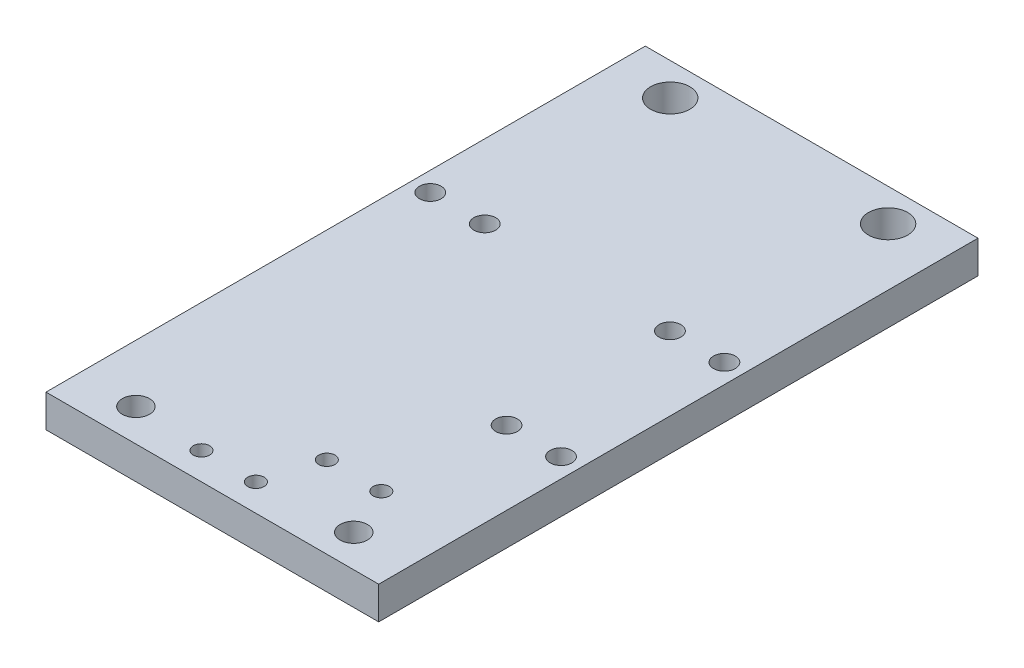
ISO-10303-21;
HEADER;
FILE_DESCRIPTION(('STEP AP214'),'2;1');
FILE_NAME('part.step','',(''),(''),'','','');
FILE_SCHEMA(('AUTOMOTIVE_DESIGN { 1 0 10303 214 1 1 1 1 }'));
ENDSEC;
DATA;
#1=APPLICATION_CONTEXT('core data for automotive mechanical design processes');
#2=APPLICATION_PROTOCOL_DEFINITION('international standard','automotive_design',2000,#1);
#3=PRODUCT_CONTEXT('',#1,'mechanical');
#4=PRODUCT('Part','Part','',(#3));
#5=PRODUCT_RELATED_PRODUCT_CATEGORY('part','',(#4));
#6=PRODUCT_DEFINITION_FORMATION('','',#4);
#7=PRODUCT_DEFINITION_CONTEXT('part definition',#1,'design');
#8=PRODUCT_DEFINITION('design','',#6,#7);
#9=PRODUCT_DEFINITION_SHAPE('','',#8);
#10=(LENGTH_UNIT() NAMED_UNIT(*) SI_UNIT(.MILLI.,.METRE.));
#11=(NAMED_UNIT(*) PLANE_ANGLE_UNIT() SI_UNIT($,.RADIAN.));
#12=(NAMED_UNIT(*) SI_UNIT($,.STERADIAN.) SOLID_ANGLE_UNIT());
#13=UNCERTAINTY_MEASURE_WITH_UNIT(LENGTH_MEASURE(1.E-05),#10,'distance_accuracy_value','');
#14=(GEOMETRIC_REPRESENTATION_CONTEXT(3) GLOBAL_UNCERTAINTY_ASSIGNED_CONTEXT((#13)) GLOBAL_UNIT_ASSIGNED_CONTEXT((#10,
#11,#12)) REPRESENTATION_CONTEXT('',''));
#15=CARTESIAN_POINT('',(0.,0.,0.));
#16=DIRECTION('',(0.,0.,1.));
#17=DIRECTION('',(1.,0.,0.));
#18=AXIS2_PLACEMENT_3D('',#15,#16,#17);
#19=CARTESIAN_POINT('',(-30.5417607223479,6.,55.0161812297735));
#20=DIRECTION('',(0.,0.,-1.));
#21=DIRECTION('',(-1.,0.,0.));
#22=AXIS2_PLACEMENT_3D('',#19,#20,#21);
#23=PLANE('',#22);
#24=DIRECTION('',(1.,0.,0.));
#25=VECTOR('',#24,1.);
#26=CARTESIAN_POINT('',(-30.5417607223479,0.,55.0161812297735));
#27=LINE('',#26,#25);
#28=CARTESIAN_POINT('',(-30.5417607223479,0.,55.0161812297735));
#29=VERTEX_POINT('',#28);
#30=CARTESIAN_POINT('',(30.5417607223479,0.,55.0161812297735));
#31=VERTEX_POINT('',#30);
#32=EDGE_CURVE('E96',#29,#31,#27,.T.);
#33=ORIENTED_EDGE('',*,*,#32,.T.);
#34=DIRECTION('',(0.,-1.,0.));
#35=VECTOR('',#34,1.);
#36=CARTESIAN_POINT('',(30.5417607223479,6.,55.0161812297735));
#37=LINE('',#36,#35);
#38=CARTESIAN_POINT('',(30.5417607223479,6.,55.0161812297735));
#39=VERTEX_POINT('',#38);
#40=EDGE_CURVE('E11',#39,#31,#37,.T.);
#41=ORIENTED_EDGE('',*,*,#40,.F.);
#42=DIRECTION('',(1.,0.,0.));
#43=VECTOR('',#42,1.);
#44=CARTESIAN_POINT('',(-30.5417607223479,6.,55.0161812297735));
#45=LINE('',#44,#43);
#46=CARTESIAN_POINT('',(-30.5417607223479,6.,55.0161812297735));
#47=VERTEX_POINT('',#46);
#48=EDGE_CURVE('E81',#47,#39,#45,.T.);
#49=ORIENTED_EDGE('',*,*,#48,.F.);
#50=DIRECTION('',(0.,-1.,0.));
#51=VECTOR('',#50,1.);
#52=CARTESIAN_POINT('',(-30.5417607223479,6.,55.0161812297735));
#53=LINE('',#52,#51);
#54=EDGE_CURVE('E92',#47,#29,#53,.T.);
#55=ORIENTED_EDGE('',*,*,#54,.T.);
#56=EDGE_LOOP('',(#33,#41,#49,#55));
#57=FACE_BOUND('',#56,.T.);
#58=ADVANCED_FACE('F32',(#57),#23,.F.);
#59=CARTESIAN_POINT('',(30.5417607223479,6.,55.0161812297735));
#60=DIRECTION('',(-1.,0.,0.));
#61=DIRECTION('',(0.,0.,1.));
#62=AXIS2_PLACEMENT_3D('',#59,#60,#61);
#63=PLANE('',#62);
#64=DIRECTION('',(0.,0.,-1.));
#65=VECTOR('',#64,1.);
#66=CARTESIAN_POINT('',(30.5417607223479,0.,55.0161812297735));
#67=LINE('',#66,#65);
#68=CARTESIAN_POINT('',(30.5417607223479,0.,-55.0161812297734));
#69=VERTEX_POINT('',#68);
#70=EDGE_CURVE('E86',#31,#69,#67,.T.);
#71=ORIENTED_EDGE('',*,*,#70,.T.);
#72=DIRECTION('',(0.,-1.,0.));
#73=VECTOR('',#72,1.);
#74=CARTESIAN_POINT('',(30.5417607223479,6.,-55.0161812297734));
#75=LINE('',#74,#73);
#76=CARTESIAN_POINT('',(30.5417607223479,6.,-55.0161812297734));
#77=VERTEX_POINT('',#76);
#78=EDGE_CURVE('E40',#77,#69,#75,.T.);
#79=ORIENTED_EDGE('',*,*,#78,.F.);
#80=DIRECTION('',(0.,0.,-1.));
#81=VECTOR('',#80,1.);
#82=CARTESIAN_POINT('',(30.5417607223479,6.,55.0161812297735));
#83=LINE('',#82,#81);
#84=EDGE_CURVE('E75',#39,#77,#83,.T.);
#85=ORIENTED_EDGE('',*,*,#84,.F.);
#86=ORIENTED_EDGE('',*,*,#40,.T.);
#87=EDGE_LOOP('',(#71,#79,#85,#86));
#88=FACE_BOUND('',#87,.T.);
#89=ADVANCED_FACE('F85',(#88),#63,.F.);
#90=CARTESIAN_POINT('',(30.5417607223479,6.,-55.0161812297734));
#91=DIRECTION('',(0.,0.,1.));
#92=DIRECTION('',(1.,0.,0.));
#93=AXIS2_PLACEMENT_3D('',#90,#91,#92);
#94=PLANE('',#93);
#95=DIRECTION('',(-1.,0.,0.));
#96=VECTOR('',#95,1.);
#97=CARTESIAN_POINT('',(30.5417607223479,0.,-55.0161812297734));
#98=LINE('',#97,#96);
#99=CARTESIAN_POINT('',(-30.5417607223479,0.,-55.0161812297734));
#100=VERTEX_POINT('',#99);
#101=EDGE_CURVE('E101',#69,#100,#98,.T.);
#102=ORIENTED_EDGE('',*,*,#101,.T.);
#103=DIRECTION('',(0.,-1.,0.));
#104=VECTOR('',#103,1.);
#105=CARTESIAN_POINT('',(-30.5417607223479,6.,-55.0161812297734));
#106=LINE('',#105,#104);
#107=CARTESIAN_POINT('',(-30.5417607223479,6.,-55.0161812297734));
#108=VERTEX_POINT('',#107);
#109=EDGE_CURVE('E89',#108,#100,#106,.T.);
#110=ORIENTED_EDGE('',*,*,#109,.F.);
#111=DIRECTION('',(-1.,0.,0.));
#112=VECTOR('',#111,1.);
#113=CARTESIAN_POINT('',(30.5417607223479,6.,-55.0161812297734));
#114=LINE('',#113,#112);
#115=EDGE_CURVE('E78',#77,#108,#114,.T.);
#116=ORIENTED_EDGE('',*,*,#115,.F.);
#117=ORIENTED_EDGE('',*,*,#78,.T.);
#118=EDGE_LOOP('',(#102,#110,#116,#117));
#119=FACE_BOUND('',#118,.T.);
#120=ADVANCED_FACE('F90',(#119),#94,.F.);
#121=CARTESIAN_POINT('',(-30.5417607223479,6.,-29.2));
#122=DIRECTION('',(1.,0.,0.));
#123=DIRECTION('',(0.,0.,-1.));
#124=AXIS2_PLACEMENT_3D('',#121,#122,#123);
#125=PLANE('',#124);
#126=DIRECTION('',(0.,0.,1.));
#127=VECTOR('',#126,1.);
#128=CARTESIAN_POINT('',(-30.5417607223479,0.,-29.2));
#129=LINE('',#128,#127);
#130=EDGE_CURVE('E65',#100,#29,#129,.T.);
#131=ORIENTED_EDGE('',*,*,#130,.T.);
#132=ORIENTED_EDGE('',*,*,#54,.F.);
#133=DIRECTION('',(0.,0.,-1.));
#134=VECTOR('',#133,1.);
#135=CARTESIAN_POINT('',(-30.5417607223479,6.,-29.2));
#136=LINE('',#135,#134);
#137=EDGE_CURVE('E48',#47,#108,#136,.T.);
#138=ORIENTED_EDGE('',*,*,#137,.T.);
#139=ORIENTED_EDGE('',*,*,#109,.T.);
#140=EDGE_LOOP('',(#131,#132,#138,#139));
#141=FACE_BOUND('',#140,.T.);
#142=ADVANCED_FACE('F105',(#141),#125,.F.);
#143=CARTESIAN_POINT('',(0.,6.,0.));
#144=DIRECTION('',(0.,1.,0.));
#145=DIRECTION('',(0.,0.,1.));
#146=AXIS2_PLACEMENT_3D('',#143,#144,#145);
#147=PLANE('',#146);
#148=CARTESIAN_POINT('',(16.,6.,40.));
#149=DIRECTION('',(0.,1.,0.));
#150=DIRECTION('',(0.,0.,1.));
#151=AXIS2_PLACEMENT_3D('',#148,#149,#150);
#152=CIRCLE('',#151,1.5);
#153=CARTESIAN_POINT('',(16.,6.,41.5));
#154=VERTEX_POINT('',#153);
#155=EDGE_CURVE('E187',#154,#154,#152,.T.);
#156=ORIENTED_EDGE('',*,*,#155,.F.);
#157=EDGE_LOOP('',(#156));
#158=FACE_BOUND('',#157,.T.);
#159=CARTESIAN_POINT('',(6.,6.,40.));
#160=DIRECTION('',(0.,1.,0.));
#161=DIRECTION('',(0.,0.,1.));
#162=AXIS2_PLACEMENT_3D('',#159,#160,#161);
#163=CIRCLE('',#162,1.5);
#164=CARTESIAN_POINT('',(6.,6.,41.5));
#165=VERTEX_POINT('',#164);
#166=EDGE_CURVE('E181',#165,#165,#163,.T.);
#167=ORIENTED_EDGE('',*,*,#166,.F.);
#168=EDGE_LOOP('',(#167));
#169=FACE_BOUND('',#168,.T.);
#170=CARTESIAN_POINT('',(-17.,6.,-12.));
#171=DIRECTION('',(0.,1.,0.));
#172=DIRECTION('',(0.,0.,1.));
#173=AXIS2_PLACEMENT_3D('',#170,#171,#172);
#174=CIRCLE('',#173,2.);
#175=CARTESIAN_POINT('',(-17.,6.,-10.));
#176=VERTEX_POINT('',#175);
#177=EDGE_CURVE('E175',#176,#176,#174,.T.);
#178=ORIENTED_EDGE('',*,*,#177,.F.);
#179=EDGE_LOOP('',(#178));
#180=FACE_BOUND('',#179,.T.);
#181=CARTESIAN_POINT('',(-27.,6.,-12.));
#182=DIRECTION('',(0.,1.,0.));
#183=DIRECTION('',(0.,0.,1.));
#184=AXIS2_PLACEMENT_3D('',#181,#182,#183);
#185=CIRCLE('',#184,2.);
#186=CARTESIAN_POINT('',(-27.,6.,-10.));
#187=VERTEX_POINT('',#186);
#188=EDGE_CURVE('E169',#187,#187,#185,.T.);
#189=ORIENTED_EDGE('',*,*,#188,.F.);
#190=EDGE_LOOP('',(#189));
#191=FACE_BOUND('',#190,.T.);
#192=CARTESIAN_POINT('',(3.,6.,50.0161812297735));
#193=DIRECTION('',(0.,1.,0.));
#194=DIRECTION('',(0.,0.,1.));
#195=AXIS2_PLACEMENT_3D('',#192,#193,#194);
#196=CIRCLE('',#195,1.5);
#197=CARTESIAN_POINT('',(3.,6.,51.5161812297735));
#198=VERTEX_POINT('',#197);
#199=EDGE_CURVE('E163',#198,#198,#196,.T.);
#200=ORIENTED_EDGE('',*,*,#199,.F.);
#201=EDGE_LOOP('',(#200));
#202=FACE_BOUND('',#201,.T.);
#203=CARTESIAN_POINT('',(-7.,6.,50.0161812297735));
#204=DIRECTION('',(0.,1.,0.));
#205=DIRECTION('',(0.,0.,1.));
#206=AXIS2_PLACEMENT_3D('',#203,#204,#205);
#207=CIRCLE('',#206,1.5);
#208=CARTESIAN_POINT('',(-7.,6.,51.5161812297735));
#209=VERTEX_POINT('',#208);
#210=EDGE_CURVE('E157',#209,#209,#207,.T.);
#211=ORIENTED_EDGE('',*,*,#210,.F.);
#212=EDGE_LOOP('',(#211));
#213=FACE_BOUND('',#212,.T.);
#214=CARTESIAN_POINT('',(17.,6.,18.));
#215=DIRECTION('',(0.,1.,0.));
#216=DIRECTION('',(0.,0.,1.));
#217=AXIS2_PLACEMENT_3D('',#214,#215,#216);
#218=CIRCLE('',#217,2.);
#219=CARTESIAN_POINT('',(17.,6.,20.));
#220=VERTEX_POINT('',#219);
#221=EDGE_CURVE('E151',#220,#220,#218,.T.);
#222=ORIENTED_EDGE('',*,*,#221,.F.);
#223=EDGE_LOOP('',(#222));
#224=FACE_BOUND('',#223,.T.);
#225=CARTESIAN_POINT('',(27.,6.,18.));
#226=DIRECTION('',(0.,1.,0.));
#227=DIRECTION('',(0.,0.,1.));
#228=AXIS2_PLACEMENT_3D('',#225,#226,#227);
#229=CIRCLE('',#228,2.00000000000001);
#230=CARTESIAN_POINT('',(27.,6.,20.));
#231=VERTEX_POINT('',#230);
#232=EDGE_CURVE('E145',#231,#231,#229,.T.);
#233=ORIENTED_EDGE('',*,*,#232,.F.);
#234=EDGE_LOOP('',(#233));
#235=FACE_BOUND('',#234,.T.);
#236=CARTESIAN_POINT('',(27.,6.,-12.));
#237=DIRECTION('',(0.,1.,0.));
#238=DIRECTION('',(0.,0.,1.));
#239=AXIS2_PLACEMENT_3D('',#236,#237,#238);
#240=CIRCLE('',#239,2.);
#241=CARTESIAN_POINT('',(27.,6.,-10.));
#242=VERTEX_POINT('',#241);
#243=EDGE_CURVE('E139',#242,#242,#240,.T.);
#244=ORIENTED_EDGE('',*,*,#243,.F.);
#245=EDGE_LOOP('',(#244));
#246=FACE_BOUND('',#245,.T.);
#247=CARTESIAN_POINT('',(17.,6.,-12.));
#248=DIRECTION('',(0.,1.,0.));
#249=DIRECTION('',(0.,0.,1.));
#250=AXIS2_PLACEMENT_3D('',#247,#248,#249);
#251=CIRCLE('',#250,2.);
#252=CARTESIAN_POINT('',(17.,6.,-10.));
#253=VERTEX_POINT('',#252);
#254=EDGE_CURVE('E133',#253,#253,#251,.T.);
#255=ORIENTED_EDGE('',*,*,#254,.F.);
#256=EDGE_LOOP('',(#255));
#257=FACE_BOUND('',#256,.T.);
#258=CARTESIAN_POINT('',(-20.,6.,-49.05));
#259=DIRECTION('',(0.,1.,0.));
#260=DIRECTION('',(0.,0.,1.));
#261=AXIS2_PLACEMENT_3D('',#258,#259,#260);
#262=CIRCLE('',#261,3.6);
#263=CARTESIAN_POINT('',(-20.,6.,-45.45));
#264=VERTEX_POINT('',#263);
#265=EDGE_CURVE('E127',#264,#264,#262,.T.);
#266=ORIENTED_EDGE('',*,*,#265,.F.);
#267=EDGE_LOOP('',(#266));
#268=FACE_BOUND('',#267,.T.);
#269=CARTESIAN_POINT('',(20.,6.,-49.05));
#270=DIRECTION('',(0.,1.,0.));
#271=DIRECTION('',(0.,0.,1.));
#272=AXIS2_PLACEMENT_3D('',#269,#270,#271);
#273=CIRCLE('',#272,3.6);
#274=CARTESIAN_POINT('',(20.,6.,-45.45));
#275=VERTEX_POINT('',#274);
#276=EDGE_CURVE('E121',#275,#275,#273,.T.);
#277=ORIENTED_EDGE('',*,*,#276,.F.);
#278=EDGE_LOOP('',(#277));
#279=FACE_BOUND('',#278,.T.);
#280=CARTESIAN_POINT('',(20.,6.,49.05));
#281=DIRECTION('',(0.,1.,0.));
#282=DIRECTION('',(0.,0.,1.));
#283=AXIS2_PLACEMENT_3D('',#280,#281,#282);
#284=CIRCLE('',#283,2.5);
#285=CARTESIAN_POINT('',(20.,6.,51.55));
#286=VERTEX_POINT('',#285);
#287=EDGE_CURVE('E115',#286,#286,#284,.T.);
#288=ORIENTED_EDGE('',*,*,#287,.F.);
#289=EDGE_LOOP('',(#288));
#290=FACE_BOUND('',#289,.T.);
#291=CARTESIAN_POINT('',(-20.,6.,49.05));
#292=DIRECTION('',(0.,1.,0.));
#293=DIRECTION('',(0.,0.,1.));
#294=AXIS2_PLACEMENT_3D('',#291,#292,#293);
#295=CIRCLE('',#294,2.5);
#296=CARTESIAN_POINT('',(-20.,6.,51.55));
#297=VERTEX_POINT('',#296);
#298=EDGE_CURVE('E99',#297,#297,#295,.T.);
#299=ORIENTED_EDGE('',*,*,#298,.F.);
#300=EDGE_LOOP('',(#299));
#301=FACE_BOUND('',#300,.T.);
#302=ORIENTED_EDGE('',*,*,#48,.T.);
#303=ORIENTED_EDGE('',*,*,#84,.T.);
#304=ORIENTED_EDGE('',*,*,#115,.T.);
#305=ORIENTED_EDGE('',*,*,#137,.F.);
#306=EDGE_LOOP('',(#302,#303,#304,#305));
#307=FACE_BOUND('',#306,.T.);
#308=ADVANCED_FACE('F76',(#158,#169,#180,#191,#202,#213,#224,#235,#246,#257,#268,#279,#290,#301,
#307),#147,.T.);
#309=CARTESIAN_POINT('',(0.,0.,0.));
#310=DIRECTION('',(0.,1.,0.));
#311=DIRECTION('',(0.,0.,1.));
#312=AXIS2_PLACEMENT_3D('',#309,#310,#311);
#313=PLANE('',#312);
#314=CARTESIAN_POINT('',(16.,0.,40.));
#315=DIRECTION('',(0.,1.,0.));
#316=DIRECTION('',(0.,0.,1.));
#317=AXIS2_PLACEMENT_3D('',#314,#315,#316);
#318=CIRCLE('',#317,1.5);
#319=CARTESIAN_POINT('',(16.,0.,41.5));
#320=VERTEX_POINT('',#319);
#321=EDGE_CURVE('E184',#320,#320,#318,.T.);
#322=ORIENTED_EDGE('',*,*,#321,.T.);
#323=EDGE_LOOP('',(#322));
#324=FACE_BOUND('',#323,.T.);
#325=CARTESIAN_POINT('',(6.,0.,40.));
#326=DIRECTION('',(0.,1.,0.));
#327=DIRECTION('',(0.,0.,1.));
#328=AXIS2_PLACEMENT_3D('',#325,#326,#327);
#329=CIRCLE('',#328,1.5);
#330=CARTESIAN_POINT('',(6.,0.,41.5));
#331=VERTEX_POINT('',#330);
#332=EDGE_CURVE('E178',#331,#331,#329,.T.);
#333=ORIENTED_EDGE('',*,*,#332,.T.);
#334=EDGE_LOOP('',(#333));
#335=FACE_BOUND('',#334,.T.);
#336=CARTESIAN_POINT('',(-17.,0.,-12.));
#337=DIRECTION('',(0.,1.,0.));
#338=DIRECTION('',(0.,0.,1.));
#339=AXIS2_PLACEMENT_3D('',#336,#337,#338);
#340=CIRCLE('',#339,2.);
#341=CARTESIAN_POINT('',(-17.,0.,-10.));
#342=VERTEX_POINT('',#341);
#343=EDGE_CURVE('E172',#342,#342,#340,.T.);
#344=ORIENTED_EDGE('',*,*,#343,.T.);
#345=EDGE_LOOP('',(#344));
#346=FACE_BOUND('',#345,.T.);
#347=CARTESIAN_POINT('',(-27.,0.,-12.));
#348=DIRECTION('',(0.,1.,0.));
#349=DIRECTION('',(0.,0.,1.));
#350=AXIS2_PLACEMENT_3D('',#347,#348,#349);
#351=CIRCLE('',#350,2.);
#352=CARTESIAN_POINT('',(-27.,0.,-10.));
#353=VERTEX_POINT('',#352);
#354=EDGE_CURVE('E166',#353,#353,#351,.T.);
#355=ORIENTED_EDGE('',*,*,#354,.T.);
#356=EDGE_LOOP('',(#355));
#357=FACE_BOUND('',#356,.T.);
#358=CARTESIAN_POINT('',(3.,0.,50.0161812297735));
#359=DIRECTION('',(0.,1.,0.));
#360=DIRECTION('',(0.,0.,1.));
#361=AXIS2_PLACEMENT_3D('',#358,#359,#360);
#362=CIRCLE('',#361,1.5);
#363=CARTESIAN_POINT('',(3.,0.,51.5161812297735));
#364=VERTEX_POINT('',#363);
#365=EDGE_CURVE('E160',#364,#364,#362,.T.);
#366=ORIENTED_EDGE('',*,*,#365,.T.);
#367=EDGE_LOOP('',(#366));
#368=FACE_BOUND('',#367,.T.);
#369=CARTESIAN_POINT('',(-7.,0.,50.0161812297735));
#370=DIRECTION('',(0.,1.,0.));
#371=DIRECTION('',(0.,0.,1.));
#372=AXIS2_PLACEMENT_3D('',#369,#370,#371);
#373=CIRCLE('',#372,1.5);
#374=CARTESIAN_POINT('',(-7.,0.,51.5161812297735));
#375=VERTEX_POINT('',#374);
#376=EDGE_CURVE('E154',#375,#375,#373,.T.);
#377=ORIENTED_EDGE('',*,*,#376,.T.);
#378=EDGE_LOOP('',(#377));
#379=FACE_BOUND('',#378,.T.);
#380=CARTESIAN_POINT('',(17.,0.,18.));
#381=DIRECTION('',(0.,1.,0.));
#382=DIRECTION('',(0.,0.,1.));
#383=AXIS2_PLACEMENT_3D('',#380,#381,#382);
#384=CIRCLE('',#383,2.);
#385=CARTESIAN_POINT('',(17.,0.,20.));
#386=VERTEX_POINT('',#385);
#387=EDGE_CURVE('E148',#386,#386,#384,.T.);
#388=ORIENTED_EDGE('',*,*,#387,.T.);
#389=EDGE_LOOP('',(#388));
#390=FACE_BOUND('',#389,.T.);
#391=CARTESIAN_POINT('',(27.,0.,18.));
#392=DIRECTION('',(0.,1.,0.));
#393=DIRECTION('',(0.,0.,1.));
#394=AXIS2_PLACEMENT_3D('',#391,#392,#393);
#395=CIRCLE('',#394,2.00000000000001);
#396=CARTESIAN_POINT('',(27.,0.,20.));
#397=VERTEX_POINT('',#396);
#398=EDGE_CURVE('E142',#397,#397,#395,.T.);
#399=ORIENTED_EDGE('',*,*,#398,.T.);
#400=EDGE_LOOP('',(#399));
#401=FACE_BOUND('',#400,.T.);
#402=CARTESIAN_POINT('',(27.,0.,-12.));
#403=DIRECTION('',(0.,1.,0.));
#404=DIRECTION('',(0.,0.,1.));
#405=AXIS2_PLACEMENT_3D('',#402,#403,#404);
#406=CIRCLE('',#405,2.);
#407=CARTESIAN_POINT('',(27.,0.,-10.));
#408=VERTEX_POINT('',#407);
#409=EDGE_CURVE('E136',#408,#408,#406,.T.);
#410=ORIENTED_EDGE('',*,*,#409,.T.);
#411=EDGE_LOOP('',(#410));
#412=FACE_BOUND('',#411,.T.);
#413=CARTESIAN_POINT('',(17.,0.,-12.));
#414=DIRECTION('',(0.,1.,0.));
#415=DIRECTION('',(0.,0.,1.));
#416=AXIS2_PLACEMENT_3D('',#413,#414,#415);
#417=CIRCLE('',#416,2.);
#418=CARTESIAN_POINT('',(17.,0.,-10.));
#419=VERTEX_POINT('',#418);
#420=EDGE_CURVE('E130',#419,#419,#417,.T.);
#421=ORIENTED_EDGE('',*,*,#420,.T.);
#422=EDGE_LOOP('',(#421));
#423=FACE_BOUND('',#422,.T.);
#424=CARTESIAN_POINT('',(-20.,0.,-49.05));
#425=DIRECTION('',(0.,1.,0.));
#426=DIRECTION('',(0.,0.,1.));
#427=AXIS2_PLACEMENT_3D('',#424,#425,#426);
#428=CIRCLE('',#427,3.6);
#429=CARTESIAN_POINT('',(-20.,0.,-45.45));
#430=VERTEX_POINT('',#429);
#431=EDGE_CURVE('E124',#430,#430,#428,.T.);
#432=ORIENTED_EDGE('',*,*,#431,.T.);
#433=EDGE_LOOP('',(#432));
#434=FACE_BOUND('',#433,.T.);
#435=CARTESIAN_POINT('',(20.,0.,-49.05));
#436=DIRECTION('',(0.,1.,0.));
#437=DIRECTION('',(0.,0.,1.));
#438=AXIS2_PLACEMENT_3D('',#435,#436,#437);
#439=CIRCLE('',#438,3.6);
#440=CARTESIAN_POINT('',(20.,0.,-45.45));
#441=VERTEX_POINT('',#440);
#442=EDGE_CURVE('E118',#441,#441,#439,.T.);
#443=ORIENTED_EDGE('',*,*,#442,.T.);
#444=EDGE_LOOP('',(#443));
#445=FACE_BOUND('',#444,.T.);
#446=CARTESIAN_POINT('',(20.,0.,49.05));
#447=DIRECTION('',(0.,1.,0.));
#448=DIRECTION('',(0.,0.,1.));
#449=AXIS2_PLACEMENT_3D('',#446,#447,#448);
#450=CIRCLE('',#449,2.5);
#451=CARTESIAN_POINT('',(20.,0.,51.55));
#452=VERTEX_POINT('',#451);
#453=EDGE_CURVE('E112',#452,#452,#450,.T.);
#454=ORIENTED_EDGE('',*,*,#453,.T.);
#455=EDGE_LOOP('',(#454));
#456=FACE_BOUND('',#455,.T.);
#457=CARTESIAN_POINT('',(-20.,0.,49.05));
#458=DIRECTION('',(0.,1.,0.));
#459=DIRECTION('',(0.,0.,1.));
#460=AXIS2_PLACEMENT_3D('',#457,#458,#459);
#461=CIRCLE('',#460,2.5);
#462=CARTESIAN_POINT('',(-20.,0.,51.55));
#463=VERTEX_POINT('',#462);
#464=EDGE_CURVE('E109',#463,#463,#461,.T.);
#465=ORIENTED_EDGE('',*,*,#464,.T.);
#466=EDGE_LOOP('',(#465));
#467=FACE_BOUND('',#466,.T.);
#468=ORIENTED_EDGE('',*,*,#32,.F.);
#469=ORIENTED_EDGE('',*,*,#130,.F.);
#470=ORIENTED_EDGE('',*,*,#101,.F.);
#471=ORIENTED_EDGE('',*,*,#70,.F.);
#472=EDGE_LOOP('',(#468,#469,#470,#471));
#473=FACE_BOUND('',#472,.T.);
#474=ADVANCED_FACE('F106',(#324,#335,#346,#357,#368,#379,#390,#401,#412,#423,#434,#445,#456,
#467,#473),#313,.F.);
#475=CARTESIAN_POINT('',(-20.,6.,49.05));
#476=DIRECTION('',(0.,-1.,0.));
#477=DIRECTION('',(0.,0.,-1.));
#478=AXIS2_PLACEMENT_3D('',#475,#476,#477);
#479=CYLINDRICAL_SURFACE('',#478,2.5);
#480=ORIENTED_EDGE('',*,*,#298,.T.);
#481=EDGE_LOOP('',(#480));
#482=FACE_BOUND('',#481,.T.);
#483=ORIENTED_EDGE('',*,*,#464,.F.);
#484=EDGE_LOOP('',(#483));
#485=FACE_BOUND('',#484,.T.);
#486=ADVANCED_FACE('F219',(#482,#485),#479,.F.);
#487=CARTESIAN_POINT('',(20.,6.,49.05));
#488=DIRECTION('',(0.,-1.,0.));
#489=DIRECTION('',(0.,0.,-1.));
#490=AXIS2_PLACEMENT_3D('',#487,#488,#489);
#491=CYLINDRICAL_SURFACE('',#490,2.5);
#492=ORIENTED_EDGE('',*,*,#287,.T.);
#493=EDGE_LOOP('',(#492));
#494=FACE_BOUND('',#493,.T.);
#495=ORIENTED_EDGE('',*,*,#453,.F.);
#496=EDGE_LOOP('',(#495));
#497=FACE_BOUND('',#496,.T.);
#498=ADVANCED_FACE('F225',(#494,#497),#491,.F.);
#499=CARTESIAN_POINT('',(20.,6.,-49.05));
#500=DIRECTION('',(0.,-1.,0.));
#501=DIRECTION('',(0.,0.,-1.));
#502=AXIS2_PLACEMENT_3D('',#499,#500,#501);
#503=CYLINDRICAL_SURFACE('',#502,3.6);
#504=ORIENTED_EDGE('',*,*,#276,.T.);
#505=EDGE_LOOP('',(#504));
#506=FACE_BOUND('',#505,.T.);
#507=ORIENTED_EDGE('',*,*,#442,.F.);
#508=EDGE_LOOP('',(#507));
#509=FACE_BOUND('',#508,.T.);
#510=ADVANCED_FACE('F229',(#506,#509),#503,.F.);
#511=CARTESIAN_POINT('',(-20.,6.,-49.05));
#512=DIRECTION('',(0.,-1.,0.));
#513=DIRECTION('',(0.,0.,-1.));
#514=AXIS2_PLACEMENT_3D('',#511,#512,#513);
#515=CYLINDRICAL_SURFACE('',#514,3.6);
#516=ORIENTED_EDGE('',*,*,#265,.T.);
#517=EDGE_LOOP('',(#516));
#518=FACE_BOUND('',#517,.T.);
#519=ORIENTED_EDGE('',*,*,#431,.F.);
#520=EDGE_LOOP('',(#519));
#521=FACE_BOUND('',#520,.T.);
#522=ADVANCED_FACE('F233',(#518,#521),#515,.F.);
#523=CARTESIAN_POINT('',(17.,6.,-12.));
#524=DIRECTION('',(0.,-1.,0.));
#525=DIRECTION('',(0.,0.,-1.));
#526=AXIS2_PLACEMENT_3D('',#523,#524,#525);
#527=CYLINDRICAL_SURFACE('',#526,2.);
#528=ORIENTED_EDGE('',*,*,#254,.T.);
#529=EDGE_LOOP('',(#528));
#530=FACE_BOUND('',#529,.T.);
#531=ORIENTED_EDGE('',*,*,#420,.F.);
#532=EDGE_LOOP('',(#531));
#533=FACE_BOUND('',#532,.T.);
#534=ADVANCED_FACE('F237',(#530,#533),#527,.F.);
#535=CARTESIAN_POINT('',(27.,6.,-12.));
#536=DIRECTION('',(0.,-1.,0.));
#537=DIRECTION('',(0.,0.,-1.));
#538=AXIS2_PLACEMENT_3D('',#535,#536,#537);
#539=CYLINDRICAL_SURFACE('',#538,2.);
#540=ORIENTED_EDGE('',*,*,#243,.T.);
#541=EDGE_LOOP('',(#540));
#542=FACE_BOUND('',#541,.T.);
#543=ORIENTED_EDGE('',*,*,#409,.F.);
#544=EDGE_LOOP('',(#543));
#545=FACE_BOUND('',#544,.T.);
#546=ADVANCED_FACE('F241',(#542,#545),#539,.F.);
#547=CARTESIAN_POINT('',(27.,6.,18.));
#548=DIRECTION('',(0.,-1.,0.));
#549=DIRECTION('',(0.,0.,-1.));
#550=AXIS2_PLACEMENT_3D('',#547,#548,#549);
#551=CYLINDRICAL_SURFACE('',#550,2.00000000000001);
#552=ORIENTED_EDGE('',*,*,#232,.T.);
#553=EDGE_LOOP('',(#552));
#554=FACE_BOUND('',#553,.T.);
#555=ORIENTED_EDGE('',*,*,#398,.F.);
#556=EDGE_LOOP('',(#555));
#557=FACE_BOUND('',#556,.T.);
#558=ADVANCED_FACE('F245',(#554,#557),#551,.F.);
#559=CARTESIAN_POINT('',(17.,6.,18.));
#560=DIRECTION('',(0.,-1.,0.));
#561=DIRECTION('',(0.,0.,-1.));
#562=AXIS2_PLACEMENT_3D('',#559,#560,#561);
#563=CYLINDRICAL_SURFACE('',#562,2.);
#564=ORIENTED_EDGE('',*,*,#221,.T.);
#565=EDGE_LOOP('',(#564));
#566=FACE_BOUND('',#565,.T.);
#567=ORIENTED_EDGE('',*,*,#387,.F.);
#568=EDGE_LOOP('',(#567));
#569=FACE_BOUND('',#568,.T.);
#570=ADVANCED_FACE('F249',(#566,#569),#563,.F.);
#571=CARTESIAN_POINT('',(-7.,6.,50.0161812297735));
#572=DIRECTION('',(0.,-1.,0.));
#573=DIRECTION('',(0.,0.,-1.));
#574=AXIS2_PLACEMENT_3D('',#571,#572,#573);
#575=CYLINDRICAL_SURFACE('',#574,1.5);
#576=ORIENTED_EDGE('',*,*,#210,.T.);
#577=EDGE_LOOP('',(#576));
#578=FACE_BOUND('',#577,.T.);
#579=ORIENTED_EDGE('',*,*,#376,.F.);
#580=EDGE_LOOP('',(#579));
#581=FACE_BOUND('',#580,.T.);
#582=ADVANCED_FACE('F253',(#578,#581),#575,.F.);
#583=CARTESIAN_POINT('',(3.,6.,50.0161812297735));
#584=DIRECTION('',(0.,-1.,0.));
#585=DIRECTION('',(0.,0.,-1.));
#586=AXIS2_PLACEMENT_3D('',#583,#584,#585);
#587=CYLINDRICAL_SURFACE('',#586,1.5);
#588=ORIENTED_EDGE('',*,*,#199,.T.);
#589=EDGE_LOOP('',(#588));
#590=FACE_BOUND('',#589,.T.);
#591=ORIENTED_EDGE('',*,*,#365,.F.);
#592=EDGE_LOOP('',(#591));
#593=FACE_BOUND('',#592,.T.);
#594=ADVANCED_FACE('F257',(#590,#593),#587,.F.);
#595=CARTESIAN_POINT('',(-27.,6.,-12.));
#596=DIRECTION('',(0.,-1.,0.));
#597=DIRECTION('',(0.,0.,-1.));
#598=AXIS2_PLACEMENT_3D('',#595,#596,#597);
#599=CYLINDRICAL_SURFACE('',#598,2.);
#600=ORIENTED_EDGE('',*,*,#188,.T.);
#601=EDGE_LOOP('',(#600));
#602=FACE_BOUND('',#601,.T.);
#603=ORIENTED_EDGE('',*,*,#354,.F.);
#604=EDGE_LOOP('',(#603));
#605=FACE_BOUND('',#604,.T.);
#606=ADVANCED_FACE('F261',(#602,#605),#599,.F.);
#607=CARTESIAN_POINT('',(-17.,6.,-12.));
#608=DIRECTION('',(0.,-1.,0.));
#609=DIRECTION('',(0.,0.,-1.));
#610=AXIS2_PLACEMENT_3D('',#607,#608,#609);
#611=CYLINDRICAL_SURFACE('',#610,2.);
#612=ORIENTED_EDGE('',*,*,#177,.T.);
#613=EDGE_LOOP('',(#612));
#614=FACE_BOUND('',#613,.T.);
#615=ORIENTED_EDGE('',*,*,#343,.F.);
#616=EDGE_LOOP('',(#615));
#617=FACE_BOUND('',#616,.T.);
#618=ADVANCED_FACE('F203',(#614,#617),#611,.F.);
#619=CARTESIAN_POINT('',(6.,6.,40.));
#620=DIRECTION('',(0.,-1.,0.));
#621=DIRECTION('',(0.,0.,-1.));
#622=AXIS2_PLACEMENT_3D('',#619,#620,#621);
#623=CYLINDRICAL_SURFACE('',#622,1.5);
#624=ORIENTED_EDGE('',*,*,#166,.T.);
#625=EDGE_LOOP('',(#624));
#626=FACE_BOUND('',#625,.T.);
#627=ORIENTED_EDGE('',*,*,#332,.F.);
#628=EDGE_LOOP('',(#627));
#629=FACE_BOUND('',#628,.T.);
#630=ADVANCED_FACE('F197',(#626,#629),#623,.F.);
#631=CARTESIAN_POINT('',(16.,6.,40.));
#632=DIRECTION('',(0.,-1.,0.));
#633=DIRECTION('',(0.,0.,-1.));
#634=AXIS2_PLACEMENT_3D('',#631,#632,#633);
#635=CYLINDRICAL_SURFACE('',#634,1.5);
#636=ORIENTED_EDGE('',*,*,#155,.T.);
#637=EDGE_LOOP('',(#636));
#638=FACE_BOUND('',#637,.T.);
#639=ORIENTED_EDGE('',*,*,#321,.F.);
#640=EDGE_LOOP('',(#639));
#641=FACE_BOUND('',#640,.T.);
#642=ADVANCED_FACE('F195',(#638,#641),#635,.F.);
#643=CLOSED_SHELL('',(#58,#89,#120,#142,#308,#474,#486,#498,#510,#522,#534,#546,#558,#570,#582,
#594,#606,#618,#630,#642));
#644=MANIFOLD_SOLID_BREP('B2',#643);
#645=ADVANCED_BREP_SHAPE_REPRESENTATION('',(#18,#644),#14);
#646=SHAPE_DEFINITION_REPRESENTATION(#9,#645);
ENDSEC;
END-ISO-10303-21;
